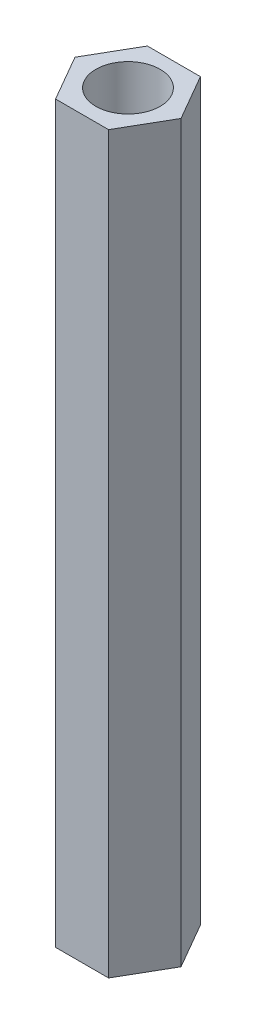
ISO-10303-21;
HEADER;
FILE_DESCRIPTION(('STEP AP214'),'2;1');
FILE_NAME('part.step','',(''),(''),'','','');
FILE_SCHEMA(('AUTOMOTIVE_DESIGN { 1 0 10303 214 1 1 1 1 }'));
ENDSEC;
DATA;
#1=APPLICATION_CONTEXT('core data for automotive mechanical design processes');
#2=APPLICATION_PROTOCOL_DEFINITION('international standard','automotive_design',2000,#1);
#3=PRODUCT_CONTEXT('',#1,'mechanical');
#4=PRODUCT('Part','Part','',(#3));
#5=PRODUCT_RELATED_PRODUCT_CATEGORY('part','',(#4));
#6=PRODUCT_DEFINITION_FORMATION('','',#4);
#7=PRODUCT_DEFINITION_CONTEXT('part definition',#1,'design');
#8=PRODUCT_DEFINITION('design','',#6,#7);
#9=PRODUCT_DEFINITION_SHAPE('','',#8);
#10=(LENGTH_UNIT() NAMED_UNIT(*) SI_UNIT(.MILLI.,.METRE.));
#11=(NAMED_UNIT(*) PLANE_ANGLE_UNIT() SI_UNIT($,.RADIAN.));
#12=(NAMED_UNIT(*) SI_UNIT($,.STERADIAN.) SOLID_ANGLE_UNIT());
#13=UNCERTAINTY_MEASURE_WITH_UNIT(LENGTH_MEASURE(1.E-05),#10,'distance_accuracy_value','');
#14=(GEOMETRIC_REPRESENTATION_CONTEXT(3) GLOBAL_UNCERTAINTY_ASSIGNED_CONTEXT((#13)) GLOBAL_UNIT_ASSIGNED_CONTEXT((#10,
#11,#12)) REPRESENTATION_CONTEXT('',''));
#15=CARTESIAN_POINT('',(0.,0.,0.));
#16=DIRECTION('',(0.,0.,1.));
#17=DIRECTION('',(1.,0.,0.));
#18=AXIS2_PLACEMENT_3D('',#15,#16,#17);
#19=CARTESIAN_POINT('',(0.,40.,0.));
#20=DIRECTION('',(0.,1.,0.));
#21=DIRECTION('',(0.,0.,1.));
#22=AXIS2_PLACEMENT_3D('',#19,#20,#21);
#23=PLANE('',#22);
#24=DIRECTION('',(0.499999999999995,0.,-0.866025403784442));
#25=VECTOR('',#24,1.);
#26=CARTESIAN_POINT('',(1.44337567297409,40.,2.49999999999999));
#27=LINE('',#26,#25);
#28=CARTESIAN_POINT('',(1.44337567297409,40.,2.49999999999999));
#29=VERTEX_POINT('',#28);
#30=CARTESIAN_POINT('',(2.88675134594813,40.,0.));
#31=VERTEX_POINT('',#30);
#32=EDGE_CURVE('E131',#29,#31,#27,.T.);
#33=ORIENTED_EDGE('',*,*,#32,.T.);
#34=DIRECTION('',(-0.500000000000001,0.,-0.866025403784438));
#35=VECTOR('',#34,1.);
#36=CARTESIAN_POINT('',(2.88675134594813,40.,0.));
#37=LINE('',#36,#35);
#38=CARTESIAN_POINT('',(1.44337567297406,40.,-2.50000000000001));
#39=VERTEX_POINT('',#38);
#40=EDGE_CURVE('E89',#31,#39,#37,.T.);
#41=ORIENTED_EDGE('',*,*,#40,.T.);
#42=DIRECTION('',(-1.,0.,0.));
#43=VECTOR('',#42,1.);
#44=CARTESIAN_POINT('',(1.44337567297406,40.,-2.50000000000001));
#45=LINE('',#44,#43);
#46=CARTESIAN_POINT('',(-1.44337567297408,40.,-2.5));
#47=VERTEX_POINT('',#46);
#48=EDGE_CURVE('E102',#39,#47,#45,.T.);
#49=ORIENTED_EDGE('',*,*,#48,.T.);
#50=DIRECTION('',(-0.499999999999995,0.,0.866025403784441));
#51=VECTOR('',#50,1.);
#52=CARTESIAN_POINT('',(-1.44337567297408,40.,-2.5));
#53=LINE('',#52,#51);
#54=CARTESIAN_POINT('',(-2.88675134594813,40.,0.));
#55=VERTEX_POINT('',#54);
#56=EDGE_CURVE('E96',#47,#55,#53,.T.);
#57=ORIENTED_EDGE('',*,*,#56,.T.);
#58=DIRECTION('',(0.500000000000007,0.,0.866025403784435));
#59=VECTOR('',#58,1.);
#60=CARTESIAN_POINT('',(-2.88675134594813,40.,0.));
#61=LINE('',#60,#59);
#62=CARTESIAN_POINT('',(-1.44337567297404,40.,2.50000000000002));
#63=VERTEX_POINT('',#62);
#64=EDGE_CURVE('E100',#55,#63,#61,.T.);
#65=ORIENTED_EDGE('',*,*,#64,.T.);
#66=DIRECTION('',(1.,0.,0.));
#67=VECTOR('',#66,1.);
#68=CARTESIAN_POINT('',(-1.44337567297404,40.,2.50000000000002));
#69=LINE('',#68,#67);
#70=EDGE_CURVE('E52',#63,#29,#69,.T.);
#71=ORIENTED_EDGE('',*,*,#70,.T.);
#72=EDGE_LOOP('',(#33,#41,#49,#57,#65,#71));
#73=FACE_BOUND('',#72,.T.);
#74=CARTESIAN_POINT('',(0.,40.,0.));
#75=DIRECTION('',(0.,1.,0.));
#76=DIRECTION('',(0.,0.,1.));
#77=AXIS2_PLACEMENT_3D('',#74,#75,#76);
#78=CIRCLE('',#77,1.75);
#79=CARTESIAN_POINT('',(0.,40.,1.75));
#80=VERTEX_POINT('',#79);
#81=EDGE_CURVE('E124',#80,#80,#78,.T.);
#82=ORIENTED_EDGE('',*,*,#81,.F.);
#83=EDGE_LOOP('',(#82));
#84=FACE_BOUND('',#83,.T.);
#85=ADVANCED_FACE('F35',(#73,#84),#23,.T.);
#86=CARTESIAN_POINT('',(0.,0.,0.));
#87=DIRECTION('',(0.,1.,0.));
#88=DIRECTION('',(0.,0.,1.));
#89=AXIS2_PLACEMENT_3D('',#86,#87,#88);
#90=PLANE('',#89);
#91=DIRECTION('',(0.499999999999995,0.,-0.866025403784442));
#92=VECTOR('',#91,1.);
#93=CARTESIAN_POINT('',(1.44337567297409,0.,2.49999999999999));
#94=LINE('',#93,#92);
#95=CARTESIAN_POINT('',(1.44337567297409,0.,2.49999999999999));
#96=VERTEX_POINT('',#95);
#97=CARTESIAN_POINT('',(2.88675134594813,0.,0.));
#98=VERTEX_POINT('',#97);
#99=EDGE_CURVE('E120',#96,#98,#94,.T.);
#100=ORIENTED_EDGE('',*,*,#99,.F.);
#101=DIRECTION('',(1.,0.,0.));
#102=VECTOR('',#101,1.);
#103=CARTESIAN_POINT('',(-1.44337567297404,0.,2.50000000000002));
#104=LINE('',#103,#102);
#105=CARTESIAN_POINT('',(-1.44337567297404,0.,2.50000000000002));
#106=VERTEX_POINT('',#105);
#107=EDGE_CURVE('E81',#106,#96,#104,.T.);
#108=ORIENTED_EDGE('',*,*,#107,.F.);
#109=DIRECTION('',(0.500000000000007,0.,0.866025403784435));
#110=VECTOR('',#109,1.);
#111=CARTESIAN_POINT('',(-2.88675134594813,0.,0.));
#112=LINE('',#111,#110);
#113=CARTESIAN_POINT('',(-2.88675134594813,0.,0.));
#114=VERTEX_POINT('',#113);
#115=EDGE_CURVE('E75',#114,#106,#112,.T.);
#116=ORIENTED_EDGE('',*,*,#115,.F.);
#117=DIRECTION('',(-0.499999999999995,0.,0.866025403784441));
#118=VECTOR('',#117,1.);
#119=CARTESIAN_POINT('',(-1.44337567297408,0.,-2.5));
#120=LINE('',#119,#118);
#121=CARTESIAN_POINT('',(-1.44337567297408,0.,-2.5));
#122=VERTEX_POINT('',#121);
#123=EDGE_CURVE('E110',#122,#114,#120,.T.);
#124=ORIENTED_EDGE('',*,*,#123,.F.);
#125=DIRECTION('',(-1.,0.,0.));
#126=VECTOR('',#125,1.);
#127=CARTESIAN_POINT('',(1.44337567297406,0.,-2.50000000000001));
#128=LINE('',#127,#126);
#129=CARTESIAN_POINT('',(1.44337567297406,0.,-2.50000000000001));
#130=VERTEX_POINT('',#129);
#131=EDGE_CURVE('E126',#130,#122,#128,.T.);
#132=ORIENTED_EDGE('',*,*,#131,.F.);
#133=DIRECTION('',(-0.500000000000001,0.,-0.866025403784438));
#134=VECTOR('',#133,1.);
#135=CARTESIAN_POINT('',(2.88675134594813,0.,0.));
#136=LINE('',#135,#134);
#137=EDGE_CURVE('E123',#98,#130,#136,.T.);
#138=ORIENTED_EDGE('',*,*,#137,.F.);
#139=EDGE_LOOP('',(#100,#108,#116,#124,#132,#138));
#140=FACE_BOUND('',#139,.T.);
#141=CARTESIAN_POINT('',(0.,0.,0.));
#142=DIRECTION('',(0.,1.,0.));
#143=DIRECTION('',(0.,0.,1.));
#144=AXIS2_PLACEMENT_3D('',#141,#142,#143);
#145=CIRCLE('',#144,1.75);
#146=CARTESIAN_POINT('',(0.,0.,1.75));
#147=VERTEX_POINT('',#146);
#148=EDGE_CURVE('E224',#147,#147,#145,.T.);
#149=ORIENTED_EDGE('',*,*,#148,.T.);
#150=EDGE_LOOP('',(#149));
#151=FACE_BOUND('',#150,.T.);
#152=ADVANCED_FACE('F140',(#140,#151),#90,.F.);
#153=CARTESIAN_POINT('',(1.44337567297409,40.,2.49999999999999));
#154=DIRECTION('',(-0.866025403784442,0.,-0.499999999999995));
#155=DIRECTION('',(-0.499999999999995,0.,0.866025403784442));
#156=AXIS2_PLACEMENT_3D('',#153,#154,#155);
#157=PLANE('',#156);
#158=ORIENTED_EDGE('',*,*,#99,.T.);
#159=DIRECTION('',(0.,-1.,0.));
#160=VECTOR('',#159,1.);
#161=CARTESIAN_POINT('',(2.88675134594813,40.,0.));
#162=LINE('',#161,#160);
#163=EDGE_CURVE('E11',#31,#98,#162,.T.);
#164=ORIENTED_EDGE('',*,*,#163,.F.);
#165=ORIENTED_EDGE('',*,*,#32,.F.);
#166=DIRECTION('',(0.,-1.,0.));
#167=VECTOR('',#166,1.);
#168=CARTESIAN_POINT('',(1.44337567297409,40.,2.49999999999999));
#169=LINE('',#168,#167);
#170=EDGE_CURVE('E116',#29,#96,#169,.T.);
#171=ORIENTED_EDGE('',*,*,#170,.T.);
#172=EDGE_LOOP('',(#158,#164,#165,#171));
#173=FACE_BOUND('',#172,.T.);
#174=ADVANCED_FACE('F37',(#173),#157,.F.);
#175=CARTESIAN_POINT('',(2.88675134594813,40.,0.));
#176=DIRECTION('',(-0.866025403784438,0.,0.500000000000001));
#177=DIRECTION('',(0.500000000000001,0.,0.866025403784438));
#178=AXIS2_PLACEMENT_3D('',#175,#176,#177);
#179=PLANE('',#178);
#180=ORIENTED_EDGE('',*,*,#137,.T.);
#181=DIRECTION('',(0.,-1.,0.));
#182=VECTOR('',#181,1.);
#183=CARTESIAN_POINT('',(1.44337567297406,40.,-2.50000000000001));
#184=LINE('',#183,#182);
#185=EDGE_CURVE('E44',#39,#130,#184,.T.);
#186=ORIENTED_EDGE('',*,*,#185,.F.);
#187=ORIENTED_EDGE('',*,*,#40,.F.);
#188=ORIENTED_EDGE('',*,*,#163,.T.);
#189=EDGE_LOOP('',(#180,#186,#187,#188));
#190=FACE_BOUND('',#189,.T.);
#191=ADVANCED_FACE('F165',(#190),#179,.F.);
#192=CARTESIAN_POINT('',(1.44337567297406,40.,-2.50000000000001));
#193=DIRECTION('',(0.,0.,1.));
#194=DIRECTION('',(1.,0.,0.));
#195=AXIS2_PLACEMENT_3D('',#192,#193,#194);
#196=PLANE('',#195);
#197=ORIENTED_EDGE('',*,*,#131,.T.);
#198=DIRECTION('',(0.,-1.,0.));
#199=VECTOR('',#198,1.);
#200=CARTESIAN_POINT('',(-1.44337567297408,40.,-2.5));
#201=LINE('',#200,#199);
#202=EDGE_CURVE('E111',#47,#122,#201,.T.);
#203=ORIENTED_EDGE('',*,*,#202,.F.);
#204=ORIENTED_EDGE('',*,*,#48,.F.);
#205=ORIENTED_EDGE('',*,*,#185,.T.);
#206=EDGE_LOOP('',(#197,#203,#204,#205));
#207=FACE_BOUND('',#206,.T.);
#208=ADVANCED_FACE('F137',(#207),#196,.F.);
#209=CARTESIAN_POINT('',(-1.44337567297408,40.,-2.5));
#210=DIRECTION('',(0.866025403784442,0.,0.499999999999995));
#211=DIRECTION('',(0.499999999999995,0.,-0.866025403784442));
#212=AXIS2_PLACEMENT_3D('',#209,#210,#211);
#213=PLANE('',#212);
#214=ORIENTED_EDGE('',*,*,#123,.T.);
#215=DIRECTION('',(0.,-1.,0.));
#216=VECTOR('',#215,1.);
#217=CARTESIAN_POINT('',(-2.88675134594813,40.,0.));
#218=LINE('',#217,#216);
#219=EDGE_CURVE('E107',#55,#114,#218,.T.);
#220=ORIENTED_EDGE('',*,*,#219,.F.);
#221=ORIENTED_EDGE('',*,*,#56,.F.);
#222=ORIENTED_EDGE('',*,*,#202,.T.);
#223=EDGE_LOOP('',(#214,#220,#221,#222));
#224=FACE_BOUND('',#223,.T.);
#225=ADVANCED_FACE('F108',(#224),#213,.F.);
#226=CARTESIAN_POINT('',(-2.88675134594813,40.,0.));
#227=DIRECTION('',(0.866025403784435,0.,-0.500000000000007));
#228=DIRECTION('',(-0.500000000000007,0.,-0.866025403784435));
#229=AXIS2_PLACEMENT_3D('',#226,#227,#228);
#230=PLANE('',#229);
#231=ORIENTED_EDGE('',*,*,#115,.T.);
#232=DIRECTION('',(0.,-1.,0.));
#233=VECTOR('',#232,1.);
#234=CARTESIAN_POINT('',(-1.44337567297404,40.,2.50000000000002));
#235=LINE('',#234,#233);
#236=EDGE_CURVE('E112',#63,#106,#235,.T.);
#237=ORIENTED_EDGE('',*,*,#236,.F.);
#238=ORIENTED_EDGE('',*,*,#64,.F.);
#239=ORIENTED_EDGE('',*,*,#219,.T.);
#240=EDGE_LOOP('',(#231,#237,#238,#239));
#241=FACE_BOUND('',#240,.T.);
#242=ADVANCED_FACE('F114',(#241),#230,.F.);
#243=CARTESIAN_POINT('',(-1.44337567297404,40.,2.50000000000002));
#244=DIRECTION('',(0.,0.,-1.));
#245=DIRECTION('',(-1.,0.,0.));
#246=AXIS2_PLACEMENT_3D('',#243,#244,#245);
#247=PLANE('',#246);
#248=ORIENTED_EDGE('',*,*,#107,.T.);
#249=ORIENTED_EDGE('',*,*,#170,.F.);
#250=ORIENTED_EDGE('',*,*,#70,.F.);
#251=ORIENTED_EDGE('',*,*,#236,.T.);
#252=EDGE_LOOP('',(#248,#249,#250,#251));
#253=FACE_BOUND('',#252,.T.);
#254=ADVANCED_FACE('F145',(#253),#247,.F.);
#255=CARTESIAN_POINT('',(0.,40.,0.));
#256=DIRECTION('',(0.,-1.,0.));
#257=DIRECTION('',(0.,0.,-1.));
#258=AXIS2_PLACEMENT_3D('',#255,#256,#257);
#259=CYLINDRICAL_SURFACE('',#258,1.75);
#260=ORIENTED_EDGE('',*,*,#81,.T.);
#261=EDGE_LOOP('',(#260));
#262=FACE_BOUND('',#261,.T.);
#263=ORIENTED_EDGE('',*,*,#148,.F.);
#264=EDGE_LOOP('',(#263));
#265=FACE_BOUND('',#264,.T.);
#266=ADVANCED_FACE('F147',(#262,#265),#259,.F.);
#267=CLOSED_SHELL('',(#85,#152,#174,#191,#208,#225,#242,#254,#266));
#268=MANIFOLD_SOLID_BREP('B2',#267);
#269=ADVANCED_BREP_SHAPE_REPRESENTATION('',(#18,#268),#14);
#270=SHAPE_DEFINITION_REPRESENTATION(#9,#269);
ENDSEC;
END-ISO-10303-21;
